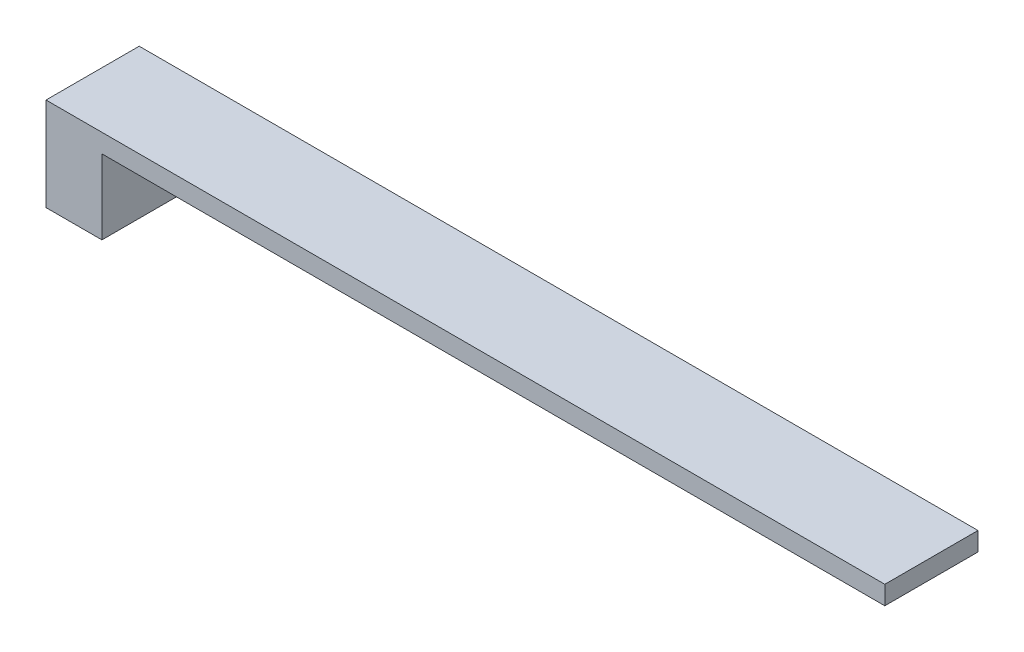
ISO-10303-21;
HEADER;
FILE_DESCRIPTION(('STEP AP214'),'2;1');
FILE_NAME('part.step','',(''),(''),'','','');
FILE_SCHEMA(('AUTOMOTIVE_DESIGN { 1 0 10303 214 1 1 1 1 }'));
ENDSEC;
DATA;
#1=APPLICATION_CONTEXT('core data for automotive mechanical design processes');
#2=APPLICATION_PROTOCOL_DEFINITION('international standard','automotive_design',2000,#1);
#3=PRODUCT_CONTEXT('',#1,'mechanical');
#4=PRODUCT('Part','Part','',(#3));
#5=PRODUCT_RELATED_PRODUCT_CATEGORY('part','',(#4));
#6=PRODUCT_DEFINITION_FORMATION('','',#4);
#7=PRODUCT_DEFINITION_CONTEXT('part definition',#1,'design');
#8=PRODUCT_DEFINITION('design','',#6,#7);
#9=PRODUCT_DEFINITION_SHAPE('','',#8);
#10=(LENGTH_UNIT() NAMED_UNIT(*) SI_UNIT(.MILLI.,.METRE.));
#11=(NAMED_UNIT(*) PLANE_ANGLE_UNIT() SI_UNIT($,.RADIAN.));
#12=(NAMED_UNIT(*) SI_UNIT($,.STERADIAN.) SOLID_ANGLE_UNIT());
#13=UNCERTAINTY_MEASURE_WITH_UNIT(LENGTH_MEASURE(1.E-05),#10,'distance_accuracy_value','');
#14=(GEOMETRIC_REPRESENTATION_CONTEXT(3) GLOBAL_UNCERTAINTY_ASSIGNED_CONTEXT((#13)) GLOBAL_UNIT_ASSIGNED_CONTEXT((#10,
#11,#12)) REPRESENTATION_CONTEXT('',''));
#15=CARTESIAN_POINT('',(0.,0.,0.));
#16=DIRECTION('',(0.,0.,1.));
#17=DIRECTION('',(1.,0.,0.));
#18=AXIS2_PLACEMENT_3D('',#15,#16,#17);
#19=CARTESIAN_POINT('',(22.5,-1.,2.5));
#20=DIRECTION('',(-1.,0.,0.));
#21=DIRECTION('',(0.,-1.,0.));
#22=AXIS2_PLACEMENT_3D('',#19,#20,#21);
#23=PLANE('',#22);
#24=DIRECTION('',(0.,0.,1.));
#25=VECTOR('',#24,1.);
#26=CARTESIAN_POINT('',(22.5,0.,2.5));
#27=LINE('',#26,#25);
#28=CARTESIAN_POINT('',(22.5,0.,-2.5));
#29=VERTEX_POINT('',#28);
#30=CARTESIAN_POINT('',(22.5,0.,2.5));
#31=VERTEX_POINT('',#30);
#32=EDGE_CURVE('E11',#29,#31,#27,.T.);
#33=ORIENTED_EDGE('',*,*,#32,.T.);
#34=DIRECTION('',(0.,1.,0.));
#35=VECTOR('',#34,1.);
#36=CARTESIAN_POINT('',(22.5,-1.,2.5));
#37=LINE('',#36,#35);
#38=CARTESIAN_POINT('',(22.5,-1.,2.5));
#39=VERTEX_POINT('',#38);
#40=EDGE_CURVE('E25',#39,#31,#37,.T.);
#41=ORIENTED_EDGE('',*,*,#40,.F.);
#42=DIRECTION('',(0.,0.,1.));
#43=VECTOR('',#42,1.);
#44=CARTESIAN_POINT('',(22.5,-1.,2.5));
#45=LINE('',#44,#43);
#46=CARTESIAN_POINT('',(22.5,-1.,-2.5));
#47=VERTEX_POINT('',#46);
#48=EDGE_CURVE('E148',#47,#39,#45,.T.);
#49=ORIENTED_EDGE('',*,*,#48,.F.);
#50=DIRECTION('',(0.,1.,0.));
#51=VECTOR('',#50,1.);
#52=CARTESIAN_POINT('',(22.5,-1.,-2.5));
#53=LINE('',#52,#51);
#54=EDGE_CURVE('E145',#47,#29,#53,.T.);
#55=ORIENTED_EDGE('',*,*,#54,.T.);
#56=EDGE_LOOP('',(#33,#41,#49,#55));
#57=FACE_BOUND('',#56,.T.);
#58=ADVANCED_FACE('F17',(#57),#23,.F.);
#59=CARTESIAN_POINT('',(-22.5,-1.,2.5));
#60=DIRECTION('',(0.,0.,-1.));
#61=DIRECTION('',(0.,1.,0.));
#62=AXIS2_PLACEMENT_3D('',#59,#60,#61);
#63=PLANE('',#62);
#64=DIRECTION('',(-1.,0.,0.));
#65=VECTOR('',#64,1.);
#66=CARTESIAN_POINT('',(-22.5,0.,2.5));
#67=LINE('',#66,#65);
#68=CARTESIAN_POINT('',(-22.5,0.,2.5));
#69=VERTEX_POINT('',#68);
#70=EDGE_CURVE('E142',#31,#69,#67,.T.);
#71=ORIENTED_EDGE('',*,*,#70,.T.);
#72=DIRECTION('',(0.,1.,0.));
#73=VECTOR('',#72,1.);
#74=CARTESIAN_POINT('',(-22.5,-1.,2.5));
#75=LINE('',#74,#73);
#76=CARTESIAN_POINT('',(-22.5,-5.,2.5));
#77=VERTEX_POINT('',#76);
#78=EDGE_CURVE('E138',#77,#69,#75,.T.);
#79=ORIENTED_EDGE('',*,*,#78,.F.);
#80=DIRECTION('',(-1.,0.,0.));
#81=VECTOR('',#80,1.);
#82=CARTESIAN_POINT('',(-22.5,-5.,2.5));
#83=LINE('',#82,#81);
#84=CARTESIAN_POINT('',(-19.5,-5.,2.5));
#85=VERTEX_POINT('',#84);
#86=EDGE_CURVE('E135',#85,#77,#83,.T.);
#87=ORIENTED_EDGE('',*,*,#86,.F.);
#88=DIRECTION('',(0.,1.,0.));
#89=VECTOR('',#88,1.);
#90=CARTESIAN_POINT('',(-19.5,-5.,2.5));
#91=LINE('',#90,#89);
#92=CARTESIAN_POINT('',(-19.5,-1.,2.5));
#93=VERTEX_POINT('',#92);
#94=EDGE_CURVE('E101',#85,#93,#91,.T.);
#95=ORIENTED_EDGE('',*,*,#94,.T.);
#96=DIRECTION('',(-1.,0.,0.));
#97=VECTOR('',#96,1.);
#98=CARTESIAN_POINT('',(-22.5,-1.,2.5));
#99=LINE('',#98,#97);
#100=EDGE_CURVE('E129',#39,#93,#99,.T.);
#101=ORIENTED_EDGE('',*,*,#100,.F.);
#102=ORIENTED_EDGE('',*,*,#40,.T.);
#103=EDGE_LOOP('',(#71,#79,#87,#95,#101,#102));
#104=FACE_BOUND('',#103,.T.);
#105=ADVANCED_FACE('F155',(#104),#63,.F.);
#106=CARTESIAN_POINT('',(-22.5,-1.,2.5));
#107=DIRECTION('',(1.,0.,0.));
#108=DIRECTION('',(0.,1.,0.));
#109=AXIS2_PLACEMENT_3D('',#106,#107,#108);
#110=PLANE('',#109);
#111=DIRECTION('',(0.,0.,-1.));
#112=VECTOR('',#111,1.);
#113=CARTESIAN_POINT('',(-22.5,0.,2.5));
#114=LINE('',#113,#112);
#115=CARTESIAN_POINT('',(-22.5,0.,-2.5));
#116=VERTEX_POINT('',#115);
#117=EDGE_CURVE('E126',#69,#116,#114,.T.);
#118=ORIENTED_EDGE('',*,*,#117,.T.);
#119=DIRECTION('',(0.,1.,0.));
#120=VECTOR('',#119,1.);
#121=CARTESIAN_POINT('',(-22.5,-1.,-2.5));
#122=LINE('',#121,#120);
#123=CARTESIAN_POINT('',(-22.5,-5.,-2.5));
#124=VERTEX_POINT('',#123);
#125=EDGE_CURVE('E123',#124,#116,#122,.T.);
#126=ORIENTED_EDGE('',*,*,#125,.F.);
#127=DIRECTION('',(0.,0.,-1.));
#128=VECTOR('',#127,1.);
#129=CARTESIAN_POINT('',(-22.5,-5.,2.5));
#130=LINE('',#129,#128);
#131=EDGE_CURVE('E109',#77,#124,#130,.T.);
#132=ORIENTED_EDGE('',*,*,#131,.F.);
#133=ORIENTED_EDGE('',*,*,#78,.T.);
#134=EDGE_LOOP('',(#118,#126,#132,#133));
#135=FACE_BOUND('',#134,.T.);
#136=ADVANCED_FACE('F161',(#135),#110,.F.);
#137=CARTESIAN_POINT('',(-22.5,-1.,-2.5));
#138=DIRECTION('',(0.,0.,1.));
#139=DIRECTION('',(0.,-1.,0.));
#140=AXIS2_PLACEMENT_3D('',#137,#138,#139);
#141=PLANE('',#140);
#142=DIRECTION('',(1.,0.,0.));
#143=VECTOR('',#142,1.);
#144=CARTESIAN_POINT('',(-22.5,0.,-2.5));
#145=LINE('',#144,#143);
#146=EDGE_CURVE('E118',#116,#29,#145,.T.);
#147=ORIENTED_EDGE('',*,*,#146,.T.);
#148=ORIENTED_EDGE('',*,*,#54,.F.);
#149=DIRECTION('',(1.,0.,0.));
#150=VECTOR('',#149,1.);
#151=CARTESIAN_POINT('',(-22.5,-1.,-2.5));
#152=LINE('',#151,#150);
#153=CARTESIAN_POINT('',(-19.5,-1.,-2.5));
#154=VERTEX_POINT('',#153);
#155=EDGE_CURVE('E91',#154,#47,#152,.T.);
#156=ORIENTED_EDGE('',*,*,#155,.F.);
#157=DIRECTION('',(0.,1.,0.));
#158=VECTOR('',#157,1.);
#159=CARTESIAN_POINT('',(-19.5,-5.,-2.5));
#160=LINE('',#159,#158);
#161=CARTESIAN_POINT('',(-19.5,-5.,-2.5));
#162=VERTEX_POINT('',#161);
#163=EDGE_CURVE('E81',#162,#154,#160,.T.);
#164=ORIENTED_EDGE('',*,*,#163,.F.);
#165=DIRECTION('',(1.,0.,0.));
#166=VECTOR('',#165,1.);
#167=CARTESIAN_POINT('',(-22.5,-5.,-2.5));
#168=LINE('',#167,#166);
#169=EDGE_CURVE('E87',#124,#162,#168,.T.);
#170=ORIENTED_EDGE('',*,*,#169,.F.);
#171=ORIENTED_EDGE('',*,*,#125,.T.);
#172=EDGE_LOOP('',(#147,#148,#156,#164,#170,#171));
#173=FACE_BOUND('',#172,.T.);
#174=ADVANCED_FACE('F84',(#173),#141,.F.);
#175=CARTESIAN_POINT('',(0.,-1.,0.));
#176=DIRECTION('',(0.,-1.,0.));
#177=DIRECTION('',(1.,0.,0.));
#178=AXIS2_PLACEMENT_3D('',#175,#176,#177);
#179=PLANE('',#178);
#180=DIRECTION('',(0.,0.,1.));
#181=VECTOR('',#180,1.);
#182=CARTESIAN_POINT('',(-19.5,-1.,2.5));
#183=LINE('',#182,#181);
#184=EDGE_CURVE('E105',#154,#93,#183,.T.);
#185=ORIENTED_EDGE('',*,*,#184,.F.);
#186=ORIENTED_EDGE('',*,*,#155,.T.);
#187=ORIENTED_EDGE('',*,*,#48,.T.);
#188=ORIENTED_EDGE('',*,*,#100,.T.);
#189=EDGE_LOOP('',(#185,#186,#187,#188));
#190=FACE_BOUND('',#189,.T.);
#191=ADVANCED_FACE('F163',(#190),#179,.T.);
#192=CARTESIAN_POINT('',(0.,0.,0.));
#193=DIRECTION('',(0.,-1.,0.));
#194=DIRECTION('',(1.,0.,0.));
#195=AXIS2_PLACEMENT_3D('',#192,#193,#194);
#196=PLANE('',#195);
#197=ORIENTED_EDGE('',*,*,#32,.F.);
#198=ORIENTED_EDGE('',*,*,#146,.F.);
#199=ORIENTED_EDGE('',*,*,#117,.F.);
#200=ORIENTED_EDGE('',*,*,#70,.F.);
#201=EDGE_LOOP('',(#197,#198,#199,#200));
#202=FACE_BOUND('',#201,.T.);
#203=ADVANCED_FACE('F158',(#202),#196,.F.);
#204=CARTESIAN_POINT('',(-19.5,-5.,2.5));
#205=DIRECTION('',(-1.,0.,0.));
#206=DIRECTION('',(0.,-1.,0.));
#207=AXIS2_PLACEMENT_3D('',#204,#205,#206);
#208=PLANE('',#207);
#209=ORIENTED_EDGE('',*,*,#184,.T.);
#210=ORIENTED_EDGE('',*,*,#94,.F.);
#211=DIRECTION('',(0.,0.,1.));
#212=VECTOR('',#211,1.);
#213=CARTESIAN_POINT('',(-19.5,-5.,2.5));
#214=LINE('',#213,#212);
#215=EDGE_CURVE('E99',#162,#85,#214,.T.);
#216=ORIENTED_EDGE('',*,*,#215,.F.);
#217=ORIENTED_EDGE('',*,*,#163,.T.);
#218=EDGE_LOOP('',(#209,#210,#216,#217));
#219=FACE_BOUND('',#218,.T.);
#220=ADVANCED_FACE('F100',(#219),#208,.F.);
#221=CARTESIAN_POINT('',(0.,-5.,0.));
#222=DIRECTION('',(0.,-1.,0.));
#223=DIRECTION('',(1.,0.,0.));
#224=AXIS2_PLACEMENT_3D('',#221,#222,#223);
#225=PLANE('',#224);
#226=ORIENTED_EDGE('',*,*,#131,.T.);
#227=ORIENTED_EDGE('',*,*,#169,.T.);
#228=ORIENTED_EDGE('',*,*,#215,.T.);
#229=ORIENTED_EDGE('',*,*,#86,.T.);
#230=EDGE_LOOP('',(#226,#227,#228,#229));
#231=FACE_BOUND('',#230,.T.);
#232=ADVANCED_FACE('F107',(#231),#225,.T.);
#233=CLOSED_SHELL('',(#58,#105,#136,#174,#191,#203,#220,#232));
#234=MANIFOLD_SOLID_BREP('B1',#233);
#235=ADVANCED_BREP_SHAPE_REPRESENTATION('',(#18,#234),#14);
#236=SHAPE_DEFINITION_REPRESENTATION(#9,#235);
ENDSEC;
END-ISO-10303-21;
